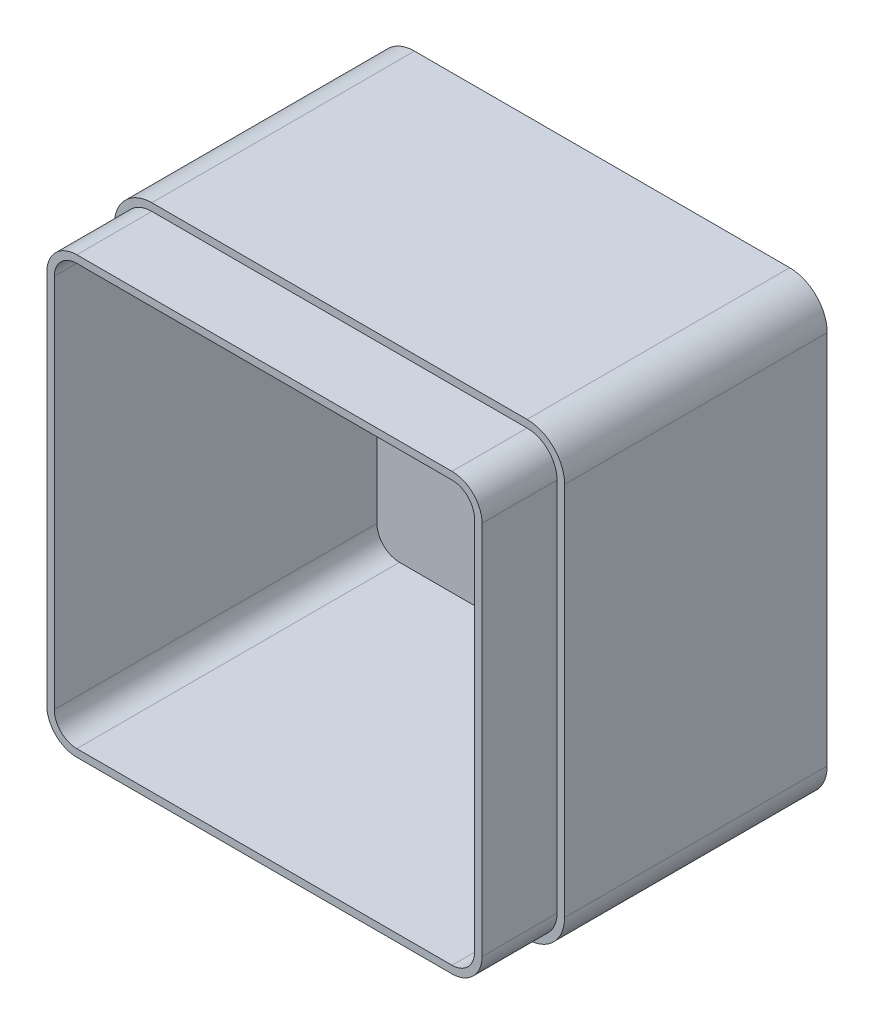
ISO-10303-21;
HEADER;
FILE_DESCRIPTION(('STEP AP214'),'2;1');
FILE_NAME('part.step','',(''),(''),'','','');
FILE_SCHEMA(('AUTOMOTIVE_DESIGN { 1 0 10303 214 1 1 1 1 }'));
ENDSEC;
DATA;
#1=APPLICATION_CONTEXT('core data for automotive mechanical design processes');
#2=APPLICATION_PROTOCOL_DEFINITION('international standard','automotive_design',2000,#1);
#3=PRODUCT_CONTEXT('',#1,'mechanical');
#4=PRODUCT('Part','Part','',(#3));
#5=PRODUCT_RELATED_PRODUCT_CATEGORY('part','',(#4));
#6=PRODUCT_DEFINITION_FORMATION('','',#4);
#7=PRODUCT_DEFINITION_CONTEXT('part definition',#1,'design');
#8=PRODUCT_DEFINITION('design','',#6,#7);
#9=PRODUCT_DEFINITION_SHAPE('','',#8);
#10=(LENGTH_UNIT() NAMED_UNIT(*) SI_UNIT(.MILLI.,.METRE.));
#11=(NAMED_UNIT(*) PLANE_ANGLE_UNIT() SI_UNIT($,.RADIAN.));
#12=(NAMED_UNIT(*) SI_UNIT($,.STERADIAN.) SOLID_ANGLE_UNIT());
#13=UNCERTAINTY_MEASURE_WITH_UNIT(LENGTH_MEASURE(1.E-05),#10,'distance_accuracy_value','');
#14=(GEOMETRIC_REPRESENTATION_CONTEXT(3) GLOBAL_UNCERTAINTY_ASSIGNED_CONTEXT((#13)) GLOBAL_UNIT_ASSIGNED_CONTEXT((#10,
#11,#12)) REPRESENTATION_CONTEXT('',''));
#15=CARTESIAN_POINT('',(0.,0.,0.));
#16=DIRECTION('',(0.,0.,1.));
#17=DIRECTION('',(1.,0.,0.));
#18=AXIS2_PLACEMENT_3D('',#15,#16,#17);
#19=CARTESIAN_POINT('',(0.,0.,90.));
#20=DIRECTION('',(0.,0.,1.));
#21=DIRECTION('',(1.,0.,0.));
#22=AXIS2_PLACEMENT_3D('',#19,#20,#21);
#23=PLANE('',#22);
#24=DIRECTION('',(1.,0.,0.));
#25=VECTOR('',#24,1.);
#26=CARTESIAN_POINT('',(-60.,-56.,90.));
#27=LINE('',#26,#25);
#28=CARTESIAN_POINT('',(-50.,-56.,90.));
#29=VERTEX_POINT('',#28);
#30=CARTESIAN_POINT('',(50.,-56.,90.));
#31=VERTEX_POINT('',#30);
#32=EDGE_CURVE('E384',#29,#31,#27,.T.);
#33=ORIENTED_EDGE('',*,*,#32,.F.);
#34=CARTESIAN_POINT('',(-50.,-50.,90.));
#35=DIRECTION('',(0.,0.,1.));
#36=DIRECTION('',(1.,0.,0.));
#37=AXIS2_PLACEMENT_3D('',#34,#35,#36);
#38=CIRCLE('',#37,6.);
#39=CARTESIAN_POINT('',(-56.,-50.,90.));
#40=VERTEX_POINT('',#39);
#41=EDGE_CURVE('E385',#40,#29,#38,.T.);
#42=ORIENTED_EDGE('',*,*,#41,.F.);
#43=DIRECTION('',(0.,-1.,0.));
#44=VECTOR('',#43,1.);
#45=CARTESIAN_POINT('',(-56.,60.,90.));
#46=LINE('',#45,#44);
#47=CARTESIAN_POINT('',(-56.,50.,90.));
#48=VERTEX_POINT('',#47);
#49=EDGE_CURVE('E357',#48,#40,#46,.T.);
#50=ORIENTED_EDGE('',*,*,#49,.F.);
#51=CARTESIAN_POINT('',(-50.,50.,90.));
#52=DIRECTION('',(0.,0.,1.));
#53=DIRECTION('',(1.,0.,0.));
#54=AXIS2_PLACEMENT_3D('',#51,#52,#53);
#55=CIRCLE('',#54,6.);
#56=CARTESIAN_POINT('',(-50.,56.,90.));
#57=VERTEX_POINT('',#56);
#58=EDGE_CURVE('E388',#57,#48,#55,.T.);
#59=ORIENTED_EDGE('',*,*,#58,.F.);
#60=DIRECTION('',(-1.,0.,0.));
#61=VECTOR('',#60,1.);
#62=CARTESIAN_POINT('',(-60.,56.,90.));
#63=LINE('',#62,#61);
#64=CARTESIAN_POINT('',(50.,56.,90.));
#65=VERTEX_POINT('',#64);
#66=EDGE_CURVE('E374',#65,#57,#63,.T.);
#67=ORIENTED_EDGE('',*,*,#66,.F.);
#68=CARTESIAN_POINT('',(50.,50.,90.));
#69=DIRECTION('',(0.,0.,1.));
#70=DIRECTION('',(1.,0.,0.));
#71=AXIS2_PLACEMENT_3D('',#68,#69,#70);
#72=CIRCLE('',#71,6.);
#73=CARTESIAN_POINT('',(56.,50.,90.));
#74=VERTEX_POINT('',#73);
#75=EDGE_CURVE('E364',#74,#65,#72,.T.);
#76=ORIENTED_EDGE('',*,*,#75,.F.);
#77=DIRECTION('',(0.,1.,0.));
#78=VECTOR('',#77,1.);
#79=CARTESIAN_POINT('',(56.,60.,90.));
#80=LINE('',#79,#78);
#81=CARTESIAN_POINT('',(56.,-50.,90.));
#82=VERTEX_POINT('',#81);
#83=EDGE_CURVE('E392',#82,#74,#80,.T.);
#84=ORIENTED_EDGE('',*,*,#83,.F.);
#85=CARTESIAN_POINT('',(50.,-50.,90.));
#86=DIRECTION('',(0.,0.,1.));
#87=DIRECTION('',(1.,0.,0.));
#88=AXIS2_PLACEMENT_3D('',#85,#86,#87);
#89=CIRCLE('',#88,6.);
#90=EDGE_CURVE('E334',#31,#82,#89,.T.);
#91=ORIENTED_EDGE('',*,*,#90,.F.);
#92=EDGE_LOOP('',(#33,#42,#50,#59,#67,#76,#84,#91));
#93=FACE_BOUND('',#92,.T.);
#94=DIRECTION('',(0.,-1.,0.));
#95=VECTOR('',#94,1.);
#96=CARTESIAN_POINT('',(-58.,50.,90.));
#97=LINE('',#96,#95);
#98=CARTESIAN_POINT('',(-58.,50.,90.));
#99=VERTEX_POINT('',#98);
#100=CARTESIAN_POINT('',(-58.,-50.,90.));
#101=VERTEX_POINT('',#100);
#102=EDGE_CURVE('E229',#99,#101,#97,.T.);
#103=ORIENTED_EDGE('',*,*,#102,.T.);
#104=CARTESIAN_POINT('',(-50.,-50.,90.));
#105=DIRECTION('',(0.,0.,1.));
#106=DIRECTION('',(1.,0.,0.));
#107=AXIS2_PLACEMENT_3D('',#104,#105,#106);
#108=CIRCLE('',#107,8.);
#109=CARTESIAN_POINT('',(-50.,-58.,90.));
#110=VERTEX_POINT('',#109);
#111=EDGE_CURVE('E256',#101,#110,#108,.T.);
#112=ORIENTED_EDGE('',*,*,#111,.T.);
#113=DIRECTION('',(1.,0.,0.));
#114=VECTOR('',#113,1.);
#115=CARTESIAN_POINT('',(-50.,-58.,90.));
#116=LINE('',#115,#114);
#117=CARTESIAN_POINT('',(50.,-58.,90.));
#118=VERTEX_POINT('',#117);
#119=EDGE_CURVE('E206',#110,#118,#116,.T.);
#120=ORIENTED_EDGE('',*,*,#119,.T.);
#121=CARTESIAN_POINT('',(50.,-50.,90.));
#122=DIRECTION('',(0.,0.,1.));
#123=DIRECTION('',(1.,0.,0.));
#124=AXIS2_PLACEMENT_3D('',#121,#122,#123);
#125=CIRCLE('',#124,8.);
#126=CARTESIAN_POINT('',(58.,-50.,90.));
#127=VERTEX_POINT('',#126);
#128=EDGE_CURVE('E54',#118,#127,#125,.T.);
#129=ORIENTED_EDGE('',*,*,#128,.T.);
#130=DIRECTION('',(0.,1.,0.));
#131=VECTOR('',#130,1.);
#132=CARTESIAN_POINT('',(58.,-50.,90.));
#133=LINE('',#132,#131);
#134=CARTESIAN_POINT('',(58.,50.,90.));
#135=VERTEX_POINT('',#134);
#136=EDGE_CURVE('E263',#127,#135,#133,.T.);
#137=ORIENTED_EDGE('',*,*,#136,.T.);
#138=CARTESIAN_POINT('',(50.,50.,90.));
#139=DIRECTION('',(0.,0.,1.));
#140=DIRECTION('',(1.,0.,0.));
#141=AXIS2_PLACEMENT_3D('',#138,#139,#140);
#142=CIRCLE('',#141,8.);
#143=CARTESIAN_POINT('',(50.,58.,90.));
#144=VERTEX_POINT('',#143);
#145=EDGE_CURVE('E267',#135,#144,#142,.T.);
#146=ORIENTED_EDGE('',*,*,#145,.T.);
#147=DIRECTION('',(-1.,0.,0.));
#148=VECTOR('',#147,1.);
#149=CARTESIAN_POINT('',(50.,58.,90.));
#150=LINE('',#149,#148);
#151=CARTESIAN_POINT('',(-50.,58.,90.));
#152=VERTEX_POINT('',#151);
#153=EDGE_CURVE('E271',#144,#152,#150,.T.);
#154=ORIENTED_EDGE('',*,*,#153,.T.);
#155=CARTESIAN_POINT('',(-50.,50.,90.));
#156=DIRECTION('',(0.,0.,1.));
#157=DIRECTION('',(1.,0.,0.));
#158=AXIS2_PLACEMENT_3D('',#155,#156,#157);
#159=CIRCLE('',#158,7.99999999999999);
#160=EDGE_CURVE('E233',#152,#99,#159,.T.);
#161=ORIENTED_EDGE('',*,*,#160,.T.);
#162=EDGE_LOOP('',(#103,#112,#120,#129,#137,#146,#154,#161));
#163=FACE_BOUND('',#162,.T.);
#164=ADVANCED_FACE('F38',(#93,#163),#23,.T.);
#165=CARTESIAN_POINT('',(-56.,60.,90.));
#166=DIRECTION('',(1.,0.,0.));
#167=DIRECTION('',(0.,1.,0.));
#168=AXIS2_PLACEMENT_3D('',#165,#166,#167);
#169=PLANE('',#168);
#170=DIRECTION('',(0.,-1.,0.));
#171=VECTOR('',#170,1.);
#172=CARTESIAN_POINT('',(-56.,60.,4.));
#173=LINE('',#172,#171);
#174=CARTESIAN_POINT('',(-56.,50.,4.));
#175=VERTEX_POINT('',#174);
#176=CARTESIAN_POINT('',(-56.,-50.,4.));
#177=VERTEX_POINT('',#176);
#178=EDGE_CURVE('E320',#175,#177,#173,.T.);
#179=ORIENTED_EDGE('',*,*,#178,.F.);
#180=DIRECTION('',(0.,0.,1.));
#181=VECTOR('',#180,1.);
#182=CARTESIAN_POINT('',(-56.,50.,90.));
#183=LINE('',#182,#181);
#184=EDGE_CURVE('E330',#48,#175,#183,.F.);
#185=ORIENTED_EDGE('',*,*,#184,.F.);
#186=ORIENTED_EDGE('',*,*,#49,.T.);
#187=DIRECTION('',(0.,0.,1.));
#188=VECTOR('',#187,1.);
#189=CARTESIAN_POINT('',(-56.,-50.,90.));
#190=LINE('',#189,#188);
#191=EDGE_CURVE('E325',#177,#40,#190,.T.);
#192=ORIENTED_EDGE('',*,*,#191,.F.);
#193=EDGE_LOOP('',(#179,#185,#186,#192));
#194=FACE_BOUND('',#193,.T.);
#195=ADVANCED_FACE('F503',(#194),#169,.T.);
#196=CARTESIAN_POINT('',(-60.,-56.,90.));
#197=DIRECTION('',(0.,1.,0.));
#198=DIRECTION('',(-1.,0.,0.));
#199=AXIS2_PLACEMENT_3D('',#196,#197,#198);
#200=PLANE('',#199);
#201=DIRECTION('',(1.,0.,0.));
#202=VECTOR('',#201,1.);
#203=CARTESIAN_POINT('',(-60.,-56.,4.));
#204=LINE('',#203,#202);
#205=CARTESIAN_POINT('',(-50.,-56.,4.));
#206=VERTEX_POINT('',#205);
#207=CARTESIAN_POINT('',(50.,-56.,4.));
#208=VERTEX_POINT('',#207);
#209=EDGE_CURVE('E324',#206,#208,#204,.T.);
#210=ORIENTED_EDGE('',*,*,#209,.F.);
#211=DIRECTION('',(0.,0.,1.));
#212=VECTOR('',#211,1.);
#213=CARTESIAN_POINT('',(-50.,-56.,90.));
#214=LINE('',#213,#212);
#215=EDGE_CURVE('E343',#29,#206,#214,.F.);
#216=ORIENTED_EDGE('',*,*,#215,.F.);
#217=ORIENTED_EDGE('',*,*,#32,.T.);
#218=DIRECTION('',(0.,0.,1.));
#219=VECTOR('',#218,1.);
#220=CARTESIAN_POINT('',(50.,-56.,90.));
#221=LINE('',#220,#219);
#222=EDGE_CURVE('E361',#208,#31,#221,.T.);
#223=ORIENTED_EDGE('',*,*,#222,.F.);
#224=EDGE_LOOP('',(#210,#216,#217,#223));
#225=FACE_BOUND('',#224,.T.);
#226=ADVANCED_FACE('F511',(#225),#200,.T.);
#227=CARTESIAN_POINT('',(56.,60.,90.));
#228=DIRECTION('',(-1.,0.,0.));
#229=DIRECTION('',(0.,-1.,0.));
#230=AXIS2_PLACEMENT_3D('',#227,#228,#229);
#231=PLANE('',#230);
#232=ORIENTED_EDGE('',*,*,#83,.T.);
#233=DIRECTION('',(0.,0.,1.));
#234=VECTOR('',#233,1.);
#235=CARTESIAN_POINT('',(56.,50.,90.));
#236=LINE('',#235,#234);
#237=CARTESIAN_POINT('',(56.,50.,4.));
#238=VERTEX_POINT('',#237);
#239=EDGE_CURVE('E371',#238,#74,#236,.T.);
#240=ORIENTED_EDGE('',*,*,#239,.F.);
#241=DIRECTION('',(0.,1.,0.));
#242=VECTOR('',#241,1.);
#243=CARTESIAN_POINT('',(56.,60.,4.));
#244=LINE('',#243,#242);
#245=CARTESIAN_POINT('',(56.,-50.,4.));
#246=VERTEX_POINT('',#245);
#247=EDGE_CURVE('E335',#246,#238,#244,.T.);
#248=ORIENTED_EDGE('',*,*,#247,.F.);
#249=DIRECTION('',(0.,0.,1.));
#250=VECTOR('',#249,1.);
#251=CARTESIAN_POINT('',(56.,-50.,90.));
#252=LINE('',#251,#250);
#253=EDGE_CURVE('E360',#82,#246,#252,.F.);
#254=ORIENTED_EDGE('',*,*,#253,.F.);
#255=EDGE_LOOP('',(#232,#240,#248,#254));
#256=FACE_BOUND('',#255,.T.);
#257=ADVANCED_FACE('F631',(#256),#231,.T.);
#258=CARTESIAN_POINT('',(-60.,56.,90.));
#259=DIRECTION('',(0.,-1.,0.));
#260=DIRECTION('',(0.,0.,-1.));
#261=AXIS2_PLACEMENT_3D('',#258,#259,#260);
#262=PLANE('',#261);
#263=DIRECTION('',(-1.,0.,0.));
#264=VECTOR('',#263,1.);
#265=CARTESIAN_POINT('',(-60.,56.,4.));
#266=LINE('',#265,#264);
#267=CARTESIAN_POINT('',(50.,56.,4.));
#268=VERTEX_POINT('',#267);
#269=CARTESIAN_POINT('',(-50.,56.,4.));
#270=VERTEX_POINT('',#269);
#271=EDGE_CURVE('E339',#268,#270,#266,.T.);
#272=ORIENTED_EDGE('',*,*,#271,.F.);
#273=DIRECTION('',(0.,0.,-1.));
#274=VECTOR('',#273,1.);
#275=CARTESIAN_POINT('',(50.,56.,90.));
#276=LINE('',#275,#274);
#277=EDGE_CURVE('E329',#65,#268,#276,.T.);
#278=ORIENTED_EDGE('',*,*,#277,.F.);
#279=ORIENTED_EDGE('',*,*,#66,.T.);
#280=DIRECTION('',(0.,0.,-1.));
#281=VECTOR('',#280,1.);
#282=CARTESIAN_POINT('',(-50.,56.,90.));
#283=LINE('',#282,#281);
#284=EDGE_CURVE('E378',#270,#57,#283,.F.);
#285=ORIENTED_EDGE('',*,*,#284,.F.);
#286=EDGE_LOOP('',(#272,#278,#279,#285));
#287=FACE_BOUND('',#286,.T.);
#288=ADVANCED_FACE('F635',(#287),#262,.T.);
#289=CARTESIAN_POINT('',(0.,0.,4.));
#290=DIRECTION('',(0.,0.,1.));
#291=DIRECTION('',(1.,0.,0.));
#292=AXIS2_PLACEMENT_3D('',#289,#290,#291);
#293=PLANE('',#292);
#294=ORIENTED_EDGE('',*,*,#247,.T.);
#295=CARTESIAN_POINT('',(50.,50.,4.));
#296=DIRECTION('',(0.,0.,1.));
#297=DIRECTION('',(1.,0.,0.));
#298=AXIS2_PLACEMENT_3D('',#295,#296,#297);
#299=CIRCLE('',#298,6.);
#300=EDGE_CURVE('E353',#268,#238,#299,.F.);
#301=ORIENTED_EDGE('',*,*,#300,.F.);
#302=ORIENTED_EDGE('',*,*,#271,.T.);
#303=CARTESIAN_POINT('',(-50.,50.,4.));
#304=DIRECTION('',(0.,0.,1.));
#305=DIRECTION('',(1.,0.,0.));
#306=AXIS2_PLACEMENT_3D('',#303,#304,#305);
#307=CIRCLE('',#306,6.);
#308=EDGE_CURVE('E350',#175,#270,#307,.F.);
#309=ORIENTED_EDGE('',*,*,#308,.F.);
#310=ORIENTED_EDGE('',*,*,#178,.T.);
#311=CARTESIAN_POINT('',(-50.,-50.,4.));
#312=DIRECTION('',(0.,0.,1.));
#313=DIRECTION('',(1.,0.,0.));
#314=AXIS2_PLACEMENT_3D('',#311,#312,#313);
#315=CIRCLE('',#314,6.);
#316=EDGE_CURVE('E344',#206,#177,#315,.F.);
#317=ORIENTED_EDGE('',*,*,#316,.F.);
#318=ORIENTED_EDGE('',*,*,#209,.T.);
#319=CARTESIAN_POINT('',(50.,-50.,4.));
#320=DIRECTION('',(0.,0.,1.));
#321=DIRECTION('',(1.,0.,0.));
#322=AXIS2_PLACEMENT_3D('',#319,#320,#321);
#323=CIRCLE('',#322,6.);
#324=EDGE_CURVE('E340',#246,#208,#323,.F.);
#325=ORIENTED_EDGE('',*,*,#324,.F.);
#326=EDGE_LOOP('',(#294,#301,#302,#309,#310,#317,#318,#325));
#327=FACE_BOUND('',#326,.T.);
#328=ADVANCED_FACE('F639',(#327),#293,.T.);
#329=CARTESIAN_POINT('',(50.,-50.,90.));
#330=DIRECTION('',(0.,0.,-1.));
#331=DIRECTION('',(-1.,0.,0.));
#332=AXIS2_PLACEMENT_3D('',#329,#330,#331);
#333=CYLINDRICAL_SURFACE('',#332,6.);
#334=ORIENTED_EDGE('',*,*,#90,.T.);
#335=ORIENTED_EDGE('',*,*,#253,.T.);
#336=ORIENTED_EDGE('',*,*,#324,.T.);
#337=ORIENTED_EDGE('',*,*,#222,.T.);
#338=EDGE_LOOP('',(#334,#335,#336,#337));
#339=FACE_BOUND('',#338,.T.);
#340=ADVANCED_FACE('F643',(#339),#333,.F.);
#341=CARTESIAN_POINT('',(-50.,-50.,90.));
#342=DIRECTION('',(0.,0.,-1.));
#343=DIRECTION('',(-1.,0.,0.));
#344=AXIS2_PLACEMENT_3D('',#341,#342,#343);
#345=CYLINDRICAL_SURFACE('',#344,6.);
#346=ORIENTED_EDGE('',*,*,#41,.T.);
#347=ORIENTED_EDGE('',*,*,#215,.T.);
#348=ORIENTED_EDGE('',*,*,#316,.T.);
#349=ORIENTED_EDGE('',*,*,#191,.T.);
#350=EDGE_LOOP('',(#346,#347,#348,#349));
#351=FACE_BOUND('',#350,.T.);
#352=ADVANCED_FACE('F647',(#351),#345,.F.);
#353=CARTESIAN_POINT('',(-50.,50.,90.));
#354=DIRECTION('',(0.,0.,-1.));
#355=DIRECTION('',(-1.,0.,0.));
#356=AXIS2_PLACEMENT_3D('',#353,#354,#355);
#357=CYLINDRICAL_SURFACE('',#356,6.);
#358=ORIENTED_EDGE('',*,*,#58,.T.);
#359=ORIENTED_EDGE('',*,*,#184,.T.);
#360=ORIENTED_EDGE('',*,*,#308,.T.);
#361=ORIENTED_EDGE('',*,*,#284,.T.);
#362=EDGE_LOOP('',(#358,#359,#360,#361));
#363=FACE_BOUND('',#362,.T.);
#364=ADVANCED_FACE('F650',(#363),#357,.F.);
#365=CARTESIAN_POINT('',(50.,50.,90.));
#366=DIRECTION('',(0.,0.,-1.));
#367=DIRECTION('',(-1.,0.,0.));
#368=AXIS2_PLACEMENT_3D('',#365,#366,#367);
#369=CYLINDRICAL_SURFACE('',#368,6.);
#370=ORIENTED_EDGE('',*,*,#75,.T.);
#371=ORIENTED_EDGE('',*,*,#277,.T.);
#372=ORIENTED_EDGE('',*,*,#300,.T.);
#373=ORIENTED_EDGE('',*,*,#239,.T.);
#374=EDGE_LOOP('',(#370,#371,#372,#373));
#375=FACE_BOUND('',#374,.T.);
#376=ADVANCED_FACE('F518',(#375),#369,.F.);
#377=CARTESIAN_POINT('',(-50.,-50.,70.));
#378=DIRECTION('',(0.,0.,1.));
#379=DIRECTION('',(1.,0.,0.));
#380=AXIS2_PLACEMENT_3D('',#377,#378,#379);
#381=PLANE('',#380);
#382=DIRECTION('',(0.,-1.,0.));
#383=VECTOR('',#382,1.);
#384=CARTESIAN_POINT('',(-58.,50.,70.));
#385=LINE('',#384,#383);
#386=CARTESIAN_POINT('',(-58.,50.,70.));
#387=VERTEX_POINT('',#386);
#388=CARTESIAN_POINT('',(-58.,-50.,70.));
#389=VERTEX_POINT('',#388);
#390=EDGE_CURVE('E213',#387,#389,#385,.T.);
#391=ORIENTED_EDGE('',*,*,#390,.F.);
#392=CARTESIAN_POINT('',(-50.,50.,70.));
#393=DIRECTION('',(0.,0.,1.));
#394=DIRECTION('',(1.,0.,0.));
#395=AXIS2_PLACEMENT_3D('',#392,#393,#394);
#396=CIRCLE('',#395,7.99999999999999);
#397=CARTESIAN_POINT('',(-50.,58.,70.));
#398=VERTEX_POINT('',#397);
#399=EDGE_CURVE('E250',#398,#387,#396,.T.);
#400=ORIENTED_EDGE('',*,*,#399,.F.);
#401=DIRECTION('',(-1.,0.,0.));
#402=VECTOR('',#401,1.);
#403=CARTESIAN_POINT('',(50.,58.,70.));
#404=LINE('',#403,#402);
#405=CARTESIAN_POINT('',(50.,58.,70.));
#406=VERTEX_POINT('',#405);
#407=EDGE_CURVE('E246',#406,#398,#404,.T.);
#408=ORIENTED_EDGE('',*,*,#407,.F.);
#409=CARTESIAN_POINT('',(50.,50.,70.));
#410=DIRECTION('',(0.,0.,1.));
#411=DIRECTION('',(1.,0.,0.));
#412=AXIS2_PLACEMENT_3D('',#409,#410,#411);
#413=CIRCLE('',#412,8.);
#414=CARTESIAN_POINT('',(58.,50.,70.));
#415=VERTEX_POINT('',#414);
#416=EDGE_CURVE('E242',#415,#406,#413,.T.);
#417=ORIENTED_EDGE('',*,*,#416,.F.);
#418=DIRECTION('',(0.,1.,0.));
#419=VECTOR('',#418,1.);
#420=CARTESIAN_POINT('',(58.,-50.,70.));
#421=LINE('',#420,#419);
#422=CARTESIAN_POINT('',(58.,-50.,70.));
#423=VERTEX_POINT('',#422);
#424=EDGE_CURVE('E238',#423,#415,#421,.T.);
#425=ORIENTED_EDGE('',*,*,#424,.F.);
#426=CARTESIAN_POINT('',(50.,-50.,70.));
#427=DIRECTION('',(0.,0.,1.));
#428=DIRECTION('',(1.,0.,0.));
#429=AXIS2_PLACEMENT_3D('',#426,#427,#428);
#430=CIRCLE('',#429,8.);
#431=CARTESIAN_POINT('',(50.,-58.,70.));
#432=VERTEX_POINT('',#431);
#433=EDGE_CURVE('E223',#432,#423,#430,.T.);
#434=ORIENTED_EDGE('',*,*,#433,.F.);
#435=DIRECTION('',(1.,0.,0.));
#436=VECTOR('',#435,1.);
#437=CARTESIAN_POINT('',(-50.,-58.,70.));
#438=LINE('',#437,#436);
#439=CARTESIAN_POINT('',(-50.,-58.,70.));
#440=VERTEX_POINT('',#439);
#441=EDGE_CURVE('E204',#440,#432,#438,.T.);
#442=ORIENTED_EDGE('',*,*,#441,.F.);
#443=CARTESIAN_POINT('',(-50.,-50.,70.));
#444=DIRECTION('',(0.,0.,1.));
#445=DIRECTION('',(1.,0.,0.));
#446=AXIS2_PLACEMENT_3D('',#443,#444,#445);
#447=CIRCLE('',#446,8.);
#448=EDGE_CURVE('E219',#389,#440,#447,.T.);
#449=ORIENTED_EDGE('',*,*,#448,.F.);
#450=EDGE_LOOP('',(#391,#400,#408,#417,#425,#434,#442,#449));
#451=FACE_BOUND('',#450,.T.);
#452=CARTESIAN_POINT('',(-50.,-50.,70.));
#453=DIRECTION('',(0.,0.,1.));
#454=DIRECTION('',(1.,0.,0.));
#455=AXIS2_PLACEMENT_3D('',#452,#453,#454);
#456=CIRCLE('',#455,10.);
#457=CARTESIAN_POINT('',(-60.,-50.,70.));
#458=VERTEX_POINT('',#457);
#459=CARTESIAN_POINT('',(-50.,-60.,70.));
#460=VERTEX_POINT('',#459);
#461=EDGE_CURVE('E280',#458,#460,#456,.T.);
#462=ORIENTED_EDGE('',*,*,#461,.T.);
#463=DIRECTION('',(1.,0.,0.));
#464=VECTOR('',#463,1.);
#465=CARTESIAN_POINT('',(-50.,-60.,70.));
#466=LINE('',#465,#464);
#467=CARTESIAN_POINT('',(50.,-60.,70.));
#468=VERTEX_POINT('',#467);
#469=EDGE_CURVE('E300',#460,#468,#466,.T.);
#470=ORIENTED_EDGE('',*,*,#469,.T.);
#471=CARTESIAN_POINT('',(50.,-50.,70.));
#472=DIRECTION('',(0.,0.,1.));
#473=DIRECTION('',(1.,0.,0.));
#474=AXIS2_PLACEMENT_3D('',#471,#472,#473);
#475=CIRCLE('',#474,10.);
#476=CARTESIAN_POINT('',(60.,-50.,70.));
#477=VERTEX_POINT('',#476);
#478=EDGE_CURVE('E303',#468,#477,#475,.T.);
#479=ORIENTED_EDGE('',*,*,#478,.T.);
#480=DIRECTION('',(0.,1.,0.));
#481=VECTOR('',#480,1.);
#482=CARTESIAN_POINT('',(60.,-50.,70.));
#483=LINE('',#482,#481);
#484=CARTESIAN_POINT('',(60.,50.,70.));
#485=VERTEX_POINT('',#484);
#486=EDGE_CURVE('E62',#477,#485,#483,.T.);
#487=ORIENTED_EDGE('',*,*,#486,.T.);
#488=CARTESIAN_POINT('',(50.,50.,70.));
#489=DIRECTION('',(0.,0.,1.));
#490=DIRECTION('',(1.,0.,0.));
#491=AXIS2_PLACEMENT_3D('',#488,#489,#490);
#492=CIRCLE('',#491,9.99999999999999);
#493=CARTESIAN_POINT('',(50.,60.,70.));
#494=VERTEX_POINT('',#493);
#495=EDGE_CURVE('E308',#485,#494,#492,.T.);
#496=ORIENTED_EDGE('',*,*,#495,.T.);
#497=DIRECTION('',(-1.,0.,0.));
#498=VECTOR('',#497,1.);
#499=CARTESIAN_POINT('',(50.,60.,70.));
#500=LINE('',#499,#498);
#501=CARTESIAN_POINT('',(-50.,60.,70.));
#502=VERTEX_POINT('',#501);
#503=EDGE_CURVE('E311',#494,#502,#500,.T.);
#504=ORIENTED_EDGE('',*,*,#503,.T.);
#505=CARTESIAN_POINT('',(-50.,50.,70.));
#506=DIRECTION('',(0.,0.,1.));
#507=DIRECTION('',(1.,0.,0.));
#508=AXIS2_PLACEMENT_3D('',#505,#506,#507);
#509=CIRCLE('',#508,9.99999999999999);
#510=CARTESIAN_POINT('',(-60.,50.,70.));
#511=VERTEX_POINT('',#510);
#512=EDGE_CURVE('E314',#502,#511,#509,.T.);
#513=ORIENTED_EDGE('',*,*,#512,.T.);
#514=DIRECTION('',(0.,-1.,0.));
#515=VECTOR('',#514,1.);
#516=CARTESIAN_POINT('',(-60.,50.,70.));
#517=LINE('',#516,#515);
#518=EDGE_CURVE('E317',#511,#458,#517,.T.);
#519=ORIENTED_EDGE('',*,*,#518,.T.);
#520=EDGE_LOOP('',(#462,#470,#479,#487,#496,#504,#513,#519));
#521=FACE_BOUND('',#520,.T.);
#522=ADVANCED_FACE('F218',(#451,#521),#381,.T.);
#523=CARTESIAN_POINT('',(-50.,-50.,70.));
#524=DIRECTION('',(0.,0.,1.));
#525=DIRECTION('',(1.,0.,0.));
#526=AXIS2_PLACEMENT_3D('',#523,#524,#525);
#527=CYLINDRICAL_SURFACE('',#526,8.);
#528=ORIENTED_EDGE('',*,*,#111,.F.);
#529=DIRECTION('',(0.,0.,1.));
#530=VECTOR('',#529,1.);
#531=CARTESIAN_POINT('',(-58.,-50.,70.));
#532=LINE('',#531,#530);
#533=EDGE_CURVE('E227',#389,#101,#532,.T.);
#534=ORIENTED_EDGE('',*,*,#533,.F.);
#535=ORIENTED_EDGE('',*,*,#448,.T.);
#536=DIRECTION('',(0.,0.,1.));
#537=VECTOR('',#536,1.);
#538=CARTESIAN_POINT('',(-50.,-58.,70.));
#539=LINE('',#538,#537);
#540=EDGE_CURVE('E201',#440,#110,#539,.T.);
#541=ORIENTED_EDGE('',*,*,#540,.T.);
#542=EDGE_LOOP('',(#528,#534,#535,#541));
#543=FACE_BOUND('',#542,.T.);
#544=ADVANCED_FACE('F226',(#543),#527,.T.);
#545=CARTESIAN_POINT('',(-58.,50.,70.));
#546=DIRECTION('',(-1.,0.,0.));
#547=DIRECTION('',(0.,0.,1.));
#548=AXIS2_PLACEMENT_3D('',#545,#546,#547);
#549=PLANE('',#548);
#550=ORIENTED_EDGE('',*,*,#102,.F.);
#551=DIRECTION('',(0.,0.,1.));
#552=VECTOR('',#551,1.);
#553=CARTESIAN_POINT('',(-58.,50.,70.));
#554=LINE('',#553,#552);
#555=EDGE_CURVE('E281',#387,#99,#554,.T.);
#556=ORIENTED_EDGE('',*,*,#555,.F.);
#557=ORIENTED_EDGE('',*,*,#390,.T.);
#558=ORIENTED_EDGE('',*,*,#533,.T.);
#559=EDGE_LOOP('',(#550,#556,#557,#558));
#560=FACE_BOUND('',#559,.T.);
#561=ADVANCED_FACE('F559',(#560),#549,.T.);
#562=CARTESIAN_POINT('',(-50.,50.,70.));
#563=DIRECTION('',(0.,0.,1.));
#564=DIRECTION('',(1.,0.,0.));
#565=AXIS2_PLACEMENT_3D('',#562,#563,#564);
#566=CYLINDRICAL_SURFACE('',#565,7.99999999999999);
#567=ORIENTED_EDGE('',*,*,#160,.F.);
#568=DIRECTION('',(0.,0.,1.));
#569=VECTOR('',#568,1.);
#570=CARTESIAN_POINT('',(-50.,58.,70.));
#571=LINE('',#570,#569);
#572=EDGE_CURVE('E284',#398,#152,#571,.T.);
#573=ORIENTED_EDGE('',*,*,#572,.F.);
#574=ORIENTED_EDGE('',*,*,#399,.T.);
#575=ORIENTED_EDGE('',*,*,#555,.T.);
#576=EDGE_LOOP('',(#567,#573,#574,#575));
#577=FACE_BOUND('',#576,.T.);
#578=ADVANCED_FACE('F567',(#577),#566,.T.);
#579=CARTESIAN_POINT('',(50.,58.,70.));
#580=DIRECTION('',(0.,1.,0.));
#581=DIRECTION('',(0.,0.,1.));
#582=AXIS2_PLACEMENT_3D('',#579,#580,#581);
#583=PLANE('',#582);
#584=ORIENTED_EDGE('',*,*,#153,.F.);
#585=DIRECTION('',(0.,0.,1.));
#586=VECTOR('',#585,1.);
#587=CARTESIAN_POINT('',(50.,58.,70.));
#588=LINE('',#587,#586);
#589=EDGE_CURVE('E287',#406,#144,#588,.T.);
#590=ORIENTED_EDGE('',*,*,#589,.F.);
#591=ORIENTED_EDGE('',*,*,#407,.T.);
#592=ORIENTED_EDGE('',*,*,#572,.T.);
#593=EDGE_LOOP('',(#584,#590,#591,#592));
#594=FACE_BOUND('',#593,.T.);
#595=ADVANCED_FACE('F576',(#594),#583,.T.);
#596=CARTESIAN_POINT('',(50.,50.,70.));
#597=DIRECTION('',(0.,0.,1.));
#598=DIRECTION('',(1.,0.,0.));
#599=AXIS2_PLACEMENT_3D('',#596,#597,#598);
#600=CYLINDRICAL_SURFACE('',#599,8.);
#601=ORIENTED_EDGE('',*,*,#145,.F.);
#602=DIRECTION('',(0.,0.,1.));
#603=VECTOR('',#602,1.);
#604=CARTESIAN_POINT('',(58.,50.,70.));
#605=LINE('',#604,#603);
#606=EDGE_CURVE('E290',#415,#135,#605,.T.);
#607=ORIENTED_EDGE('',*,*,#606,.F.);
#608=ORIENTED_EDGE('',*,*,#416,.T.);
#609=ORIENTED_EDGE('',*,*,#589,.T.);
#610=EDGE_LOOP('',(#601,#607,#608,#609));
#611=FACE_BOUND('',#610,.T.);
#612=ADVANCED_FACE('F585',(#611),#600,.T.);
#613=CARTESIAN_POINT('',(58.,-50.,70.));
#614=DIRECTION('',(1.,0.,0.));
#615=DIRECTION('',(0.,1.,0.));
#616=AXIS2_PLACEMENT_3D('',#613,#614,#615);
#617=PLANE('',#616);
#618=ORIENTED_EDGE('',*,*,#136,.F.);
#619=DIRECTION('',(0.,0.,1.));
#620=VECTOR('',#619,1.);
#621=CARTESIAN_POINT('',(58.,-50.,70.));
#622=LINE('',#621,#620);
#623=EDGE_CURVE('E293',#423,#127,#622,.T.);
#624=ORIENTED_EDGE('',*,*,#623,.F.);
#625=ORIENTED_EDGE('',*,*,#424,.T.);
#626=ORIENTED_EDGE('',*,*,#606,.T.);
#627=EDGE_LOOP('',(#618,#624,#625,#626));
#628=FACE_BOUND('',#627,.T.);
#629=ADVANCED_FACE('F594',(#628),#617,.T.);
#630=CARTESIAN_POINT('',(50.,-50.,70.));
#631=DIRECTION('',(0.,0.,1.));
#632=DIRECTION('',(1.,0.,0.));
#633=AXIS2_PLACEMENT_3D('',#630,#631,#632);
#634=CYLINDRICAL_SURFACE('',#633,8.);
#635=ORIENTED_EDGE('',*,*,#128,.F.);
#636=DIRECTION('',(0.,0.,1.));
#637=VECTOR('',#636,1.);
#638=CARTESIAN_POINT('',(50.,-58.,70.));
#639=LINE('',#638,#637);
#640=EDGE_CURVE('E212',#432,#118,#639,.T.);
#641=ORIENTED_EDGE('',*,*,#640,.F.);
#642=ORIENTED_EDGE('',*,*,#433,.T.);
#643=ORIENTED_EDGE('',*,*,#623,.T.);
#644=EDGE_LOOP('',(#635,#641,#642,#643));
#645=FACE_BOUND('',#644,.T.);
#646=ADVANCED_FACE('F603',(#645),#634,.T.);
#647=CARTESIAN_POINT('',(-50.,-58.,70.));
#648=DIRECTION('',(0.,-1.,0.));
#649=DIRECTION('',(0.,0.,-1.));
#650=AXIS2_PLACEMENT_3D('',#647,#648,#649);
#651=PLANE('',#650);
#652=ORIENTED_EDGE('',*,*,#119,.F.);
#653=ORIENTED_EDGE('',*,*,#540,.F.);
#654=ORIENTED_EDGE('',*,*,#441,.T.);
#655=ORIENTED_EDGE('',*,*,#640,.T.);
#656=EDGE_LOOP('',(#652,#653,#654,#655));
#657=FACE_BOUND('',#656,.T.);
#658=ADVANCED_FACE('F203',(#657),#651,.T.);
#659=CARTESIAN_POINT('',(0.,0.,0.));
#660=DIRECTION('',(0.,0.,1.));
#661=DIRECTION('',(1.,0.,0.));
#662=AXIS2_PLACEMENT_3D('',#659,#660,#661);
#663=PLANE('',#662);
#664=DIRECTION('',(0.,1.,0.));
#665=VECTOR('',#664,1.);
#666=CARTESIAN_POINT('',(60.,60.,0.));
#667=LINE('',#666,#665);
#668=CARTESIAN_POINT('',(60.,-50.,0.));
#669=VERTEX_POINT('',#668);
#670=CARTESIAN_POINT('',(60.,50.,0.));
#671=VERTEX_POINT('',#670);
#672=EDGE_CURVE('E412',#669,#671,#667,.T.);
#673=ORIENTED_EDGE('',*,*,#672,.F.);
#674=CARTESIAN_POINT('',(50.,-50.,0.));
#675=DIRECTION('',(0.,0.,1.));
#676=DIRECTION('',(1.,0.,0.));
#677=AXIS2_PLACEMENT_3D('',#674,#675,#676);
#678=CIRCLE('',#677,10.);
#679=CARTESIAN_POINT('',(50.,-60.,0.));
#680=VERTEX_POINT('',#679);
#681=EDGE_CURVE('E436',#669,#680,#678,.F.);
#682=ORIENTED_EDGE('',*,*,#681,.T.);
#683=DIRECTION('',(1.,0.,0.));
#684=VECTOR('',#683,1.);
#685=CARTESIAN_POINT('',(-60.,-60.,0.));
#686=LINE('',#685,#684);
#687=CARTESIAN_POINT('',(-50.,-60.,0.));
#688=VERTEX_POINT('',#687);
#689=EDGE_CURVE('E408',#688,#680,#686,.T.);
#690=ORIENTED_EDGE('',*,*,#689,.F.);
#691=CARTESIAN_POINT('',(-50.,-50.,0.));
#692=DIRECTION('',(0.,0.,1.));
#693=DIRECTION('',(1.,0.,0.));
#694=AXIS2_PLACEMENT_3D('',#691,#692,#693);
#695=CIRCLE('',#694,10.);
#696=CARTESIAN_POINT('',(-60.,-50.,0.));
#697=VERTEX_POINT('',#696);
#698=EDGE_CURVE('E433',#688,#697,#695,.F.);
#699=ORIENTED_EDGE('',*,*,#698,.T.);
#700=DIRECTION('',(0.,-1.,0.));
#701=VECTOR('',#700,1.);
#702=CARTESIAN_POINT('',(-60.,60.,0.));
#703=LINE('',#702,#701);
#704=CARTESIAN_POINT('',(-60.,50.,0.));
#705=VERTEX_POINT('',#704);
#706=EDGE_CURVE('E381',#705,#697,#703,.T.);
#707=ORIENTED_EDGE('',*,*,#706,.F.);
#708=CARTESIAN_POINT('',(-50.,50.,0.));
#709=DIRECTION('',(0.,0.,1.));
#710=DIRECTION('',(1.,0.,0.));
#711=AXIS2_PLACEMENT_3D('',#708,#709,#710);
#712=CIRCLE('',#711,10.);
#713=CARTESIAN_POINT('',(-50.,60.,0.));
#714=VERTEX_POINT('',#713);
#715=EDGE_CURVE('E430',#705,#714,#712,.F.);
#716=ORIENTED_EDGE('',*,*,#715,.T.);
#717=DIRECTION('',(-1.,0.,0.));
#718=VECTOR('',#717,1.);
#719=CARTESIAN_POINT('',(-60.,60.,0.));
#720=LINE('',#719,#718);
#721=CARTESIAN_POINT('',(50.,60.,0.));
#722=VERTEX_POINT('',#721);
#723=EDGE_CURVE('E416',#722,#714,#720,.T.);
#724=ORIENTED_EDGE('',*,*,#723,.F.);
#725=CARTESIAN_POINT('',(50.,50.,0.));
#726=DIRECTION('',(0.,0.,1.));
#727=DIRECTION('',(1.,0.,0.));
#728=AXIS2_PLACEMENT_3D('',#725,#726,#727);
#729=CIRCLE('',#728,10.);
#730=EDGE_CURVE('E427',#722,#671,#729,.F.);
#731=ORIENTED_EDGE('',*,*,#730,.T.);
#732=EDGE_LOOP('',(#673,#682,#690,#699,#707,#716,#724,#731));
#733=FACE_BOUND('',#732,.T.);
#734=ADVANCED_FACE('F464',(#733),#663,.F.);
#735=CARTESIAN_POINT('',(-50.,50.,90.));
#736=DIRECTION('',(0.,0.,-1.));
#737=DIRECTION('',(-1.,0.,0.));
#738=AXIS2_PLACEMENT_3D('',#735,#736,#737);
#739=CYLINDRICAL_SURFACE('',#738,10.);
#740=DIRECTION('',(0.,0.,-1.));
#741=VECTOR('',#740,1.);
#742=CARTESIAN_POINT('',(-60.,50.,90.));
#743=LINE('',#742,#741);
#744=EDGE_CURVE('E446',#511,#705,#743,.T.);
#745=ORIENTED_EDGE('',*,*,#744,.F.);
#746=ORIENTED_EDGE('',*,*,#512,.F.);
#747=DIRECTION('',(0.,0.,-1.));
#748=VECTOR('',#747,1.);
#749=CARTESIAN_POINT('',(-50.,60.,90.));
#750=LINE('',#749,#748);
#751=EDGE_CURVE('E11',#714,#502,#750,.F.);
#752=ORIENTED_EDGE('',*,*,#751,.F.);
#753=ORIENTED_EDGE('',*,*,#715,.F.);
#754=EDGE_LOOP('',(#745,#746,#752,#753));
#755=FACE_BOUND('',#754,.T.);
#756=ADVANCED_FACE('F469',(#755),#739,.T.);
#757=CARTESIAN_POINT('',(50.,50.,90.));
#758=DIRECTION('',(0.,0.,-1.));
#759=DIRECTION('',(-1.,0.,0.));
#760=AXIS2_PLACEMENT_3D('',#757,#758,#759);
#761=CYLINDRICAL_SURFACE('',#760,10.);
#762=DIRECTION('',(0.,0.,-1.));
#763=VECTOR('',#762,1.);
#764=CARTESIAN_POINT('',(50.,60.,90.));
#765=LINE('',#764,#763);
#766=EDGE_CURVE('E47',#494,#722,#765,.T.);
#767=ORIENTED_EDGE('',*,*,#766,.F.);
#768=ORIENTED_EDGE('',*,*,#495,.F.);
#769=DIRECTION('',(0.,0.,-1.));
#770=VECTOR('',#769,1.);
#771=CARTESIAN_POINT('',(60.,50.,90.));
#772=LINE('',#771,#770);
#773=EDGE_CURVE('E420',#671,#485,#772,.F.);
#774=ORIENTED_EDGE('',*,*,#773,.F.);
#775=ORIENTED_EDGE('',*,*,#730,.F.);
#776=EDGE_LOOP('',(#767,#768,#774,#775));
#777=FACE_BOUND('',#776,.T.);
#778=ADVANCED_FACE('F40',(#777),#761,.T.);
#779=CARTESIAN_POINT('',(-60.,60.,90.));
#780=DIRECTION('',(0.,-1.,0.));
#781=DIRECTION('',(0.,0.,-1.));
#782=AXIS2_PLACEMENT_3D('',#779,#780,#781);
#783=PLANE('',#782);
#784=ORIENTED_EDGE('',*,*,#503,.F.);
#785=ORIENTED_EDGE('',*,*,#766,.T.);
#786=ORIENTED_EDGE('',*,*,#723,.T.);
#787=ORIENTED_EDGE('',*,*,#751,.T.);
#788=EDGE_LOOP('',(#784,#785,#786,#787));
#789=FACE_BOUND('',#788,.T.);
#790=ADVANCED_FACE('F457',(#789),#783,.F.);
#791=CARTESIAN_POINT('',(50.,-50.,90.));
#792=DIRECTION('',(0.,0.,-1.));
#793=DIRECTION('',(-1.,0.,0.));
#794=AXIS2_PLACEMENT_3D('',#791,#792,#793);
#795=CYLINDRICAL_SURFACE('',#794,10.);
#796=DIRECTION('',(0.,0.,-1.));
#797=VECTOR('',#796,1.);
#798=CARTESIAN_POINT('',(60.,-50.,90.));
#799=LINE('',#798,#797);
#800=EDGE_CURVE('E424',#477,#669,#799,.T.);
#801=ORIENTED_EDGE('',*,*,#800,.F.);
#802=ORIENTED_EDGE('',*,*,#478,.F.);
#803=DIRECTION('',(0.,0.,-1.));
#804=VECTOR('',#803,1.);
#805=CARTESIAN_POINT('',(50.,-60.,90.));
#806=LINE('',#805,#804);
#807=EDGE_CURVE('E442',#680,#468,#806,.F.);
#808=ORIENTED_EDGE('',*,*,#807,.F.);
#809=ORIENTED_EDGE('',*,*,#681,.F.);
#810=EDGE_LOOP('',(#801,#802,#808,#809));
#811=FACE_BOUND('',#810,.T.);
#812=ADVANCED_FACE('F489',(#811),#795,.T.);
#813=CARTESIAN_POINT('',(60.,60.,90.));
#814=DIRECTION('',(-1.,0.,0.));
#815=DIRECTION('',(0.,-1.,0.));
#816=AXIS2_PLACEMENT_3D('',#813,#814,#815);
#817=PLANE('',#816);
#818=ORIENTED_EDGE('',*,*,#486,.F.);
#819=ORIENTED_EDGE('',*,*,#800,.T.);
#820=ORIENTED_EDGE('',*,*,#672,.T.);
#821=ORIENTED_EDGE('',*,*,#773,.T.);
#822=EDGE_LOOP('',(#818,#819,#820,#821));
#823=FACE_BOUND('',#822,.T.);
#824=ADVANCED_FACE('F491',(#823),#817,.F.);
#825=CARTESIAN_POINT('',(-50.,-50.,90.));
#826=DIRECTION('',(0.,0.,-1.));
#827=DIRECTION('',(-1.,0.,0.));
#828=AXIS2_PLACEMENT_3D('',#825,#826,#827);
#829=CYLINDRICAL_SURFACE('',#828,10.);
#830=DIRECTION('',(0.,0.,-1.));
#831=VECTOR('',#830,1.);
#832=CARTESIAN_POINT('',(-50.,-60.,90.));
#833=LINE('',#832,#831);
#834=EDGE_CURVE('E439',#460,#688,#833,.T.);
#835=ORIENTED_EDGE('',*,*,#834,.F.);
#836=ORIENTED_EDGE('',*,*,#461,.F.);
#837=DIRECTION('',(0.,0.,-1.));
#838=VECTOR('',#837,1.);
#839=CARTESIAN_POINT('',(-60.,-50.,90.));
#840=LINE('',#839,#838);
#841=EDGE_CURVE('E449',#697,#458,#840,.F.);
#842=ORIENTED_EDGE('',*,*,#841,.F.);
#843=ORIENTED_EDGE('',*,*,#698,.F.);
#844=EDGE_LOOP('',(#835,#836,#842,#843));
#845=FACE_BOUND('',#844,.T.);
#846=ADVANCED_FACE('F479',(#845),#829,.T.);
#847=CARTESIAN_POINT('',(-60.,-60.,90.));
#848=DIRECTION('',(0.,1.,0.));
#849=DIRECTION('',(-1.,0.,0.));
#850=AXIS2_PLACEMENT_3D('',#847,#848,#849);
#851=PLANE('',#850);
#852=ORIENTED_EDGE('',*,*,#469,.F.);
#853=ORIENTED_EDGE('',*,*,#834,.T.);
#854=ORIENTED_EDGE('',*,*,#689,.T.);
#855=ORIENTED_EDGE('',*,*,#807,.T.);
#856=EDGE_LOOP('',(#852,#853,#854,#855));
#857=FACE_BOUND('',#856,.T.);
#858=ADVANCED_FACE('F484',(#857),#851,.F.);
#859=CARTESIAN_POINT('',(-60.,60.,90.));
#860=DIRECTION('',(1.,0.,0.));
#861=DIRECTION('',(0.,1.,0.));
#862=AXIS2_PLACEMENT_3D('',#859,#860,#861);
#863=PLANE('',#862);
#864=ORIENTED_EDGE('',*,*,#518,.F.);
#865=ORIENTED_EDGE('',*,*,#744,.T.);
#866=ORIENTED_EDGE('',*,*,#706,.T.);
#867=ORIENTED_EDGE('',*,*,#841,.T.);
#868=EDGE_LOOP('',(#864,#865,#866,#867));
#869=FACE_BOUND('',#868,.T.);
#870=ADVANCED_FACE('F474',(#869),#863,.F.);
#871=CLOSED_SHELL('',(#164,#195,#226,#257,#288,#328,#340,#352,#364,#376,#522,#544,#561,#578,
#595,#612,#629,#646,#658,#734,#756,#778,#790,#812,#824,#846,#858,#870));
#872=MANIFOLD_SOLID_BREP('B2',#871);
#873=ADVANCED_BREP_SHAPE_REPRESENTATION('',(#18,#872),#14);
#874=SHAPE_DEFINITION_REPRESENTATION(#9,#873);
ENDSEC;
END-ISO-10303-21;
